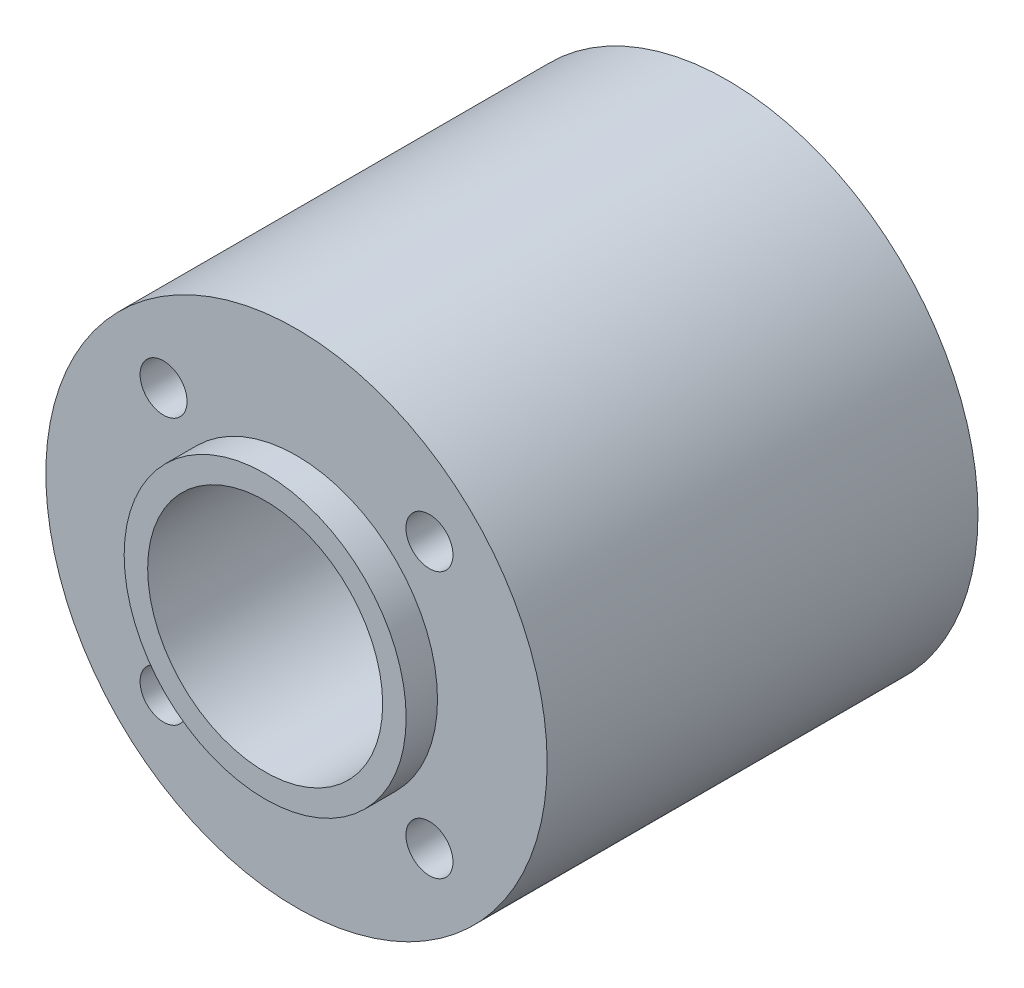
ISO-10303-21;
HEADER;
FILE_DESCRIPTION(('STEP AP214'),'2;1');
FILE_NAME('part.step','',(''),(''),'','','');
FILE_SCHEMA(('AUTOMOTIVE_DESIGN { 1 0 10303 214 1 1 1 1 }'));
ENDSEC;
DATA;
#1=APPLICATION_CONTEXT('core data for automotive mechanical design processes');
#2=APPLICATION_PROTOCOL_DEFINITION('international standard','automotive_design',2000,#1);
#3=PRODUCT_CONTEXT('',#1,'mechanical');
#4=PRODUCT('Part','Part','',(#3));
#5=PRODUCT_RELATED_PRODUCT_CATEGORY('part','',(#4));
#6=PRODUCT_DEFINITION_FORMATION('','',#4);
#7=PRODUCT_DEFINITION_CONTEXT('part definition',#1,'design');
#8=PRODUCT_DEFINITION('design','',#6,#7);
#9=PRODUCT_DEFINITION_SHAPE('','',#8);
#10=(LENGTH_UNIT() NAMED_UNIT(*) SI_UNIT(.MILLI.,.METRE.));
#11=(NAMED_UNIT(*) PLANE_ANGLE_UNIT() SI_UNIT($,.RADIAN.));
#12=(NAMED_UNIT(*) SI_UNIT($,.STERADIAN.) SOLID_ANGLE_UNIT());
#13=UNCERTAINTY_MEASURE_WITH_UNIT(LENGTH_MEASURE(1.E-05),#10,'distance_accuracy_value','');
#14=(GEOMETRIC_REPRESENTATION_CONTEXT(3) GLOBAL_UNCERTAINTY_ASSIGNED_CONTEXT((#13)) GLOBAL_UNIT_ASSIGNED_CONTEXT((#10,
#11,#12)) REPRESENTATION_CONTEXT('',''));
#15=CARTESIAN_POINT('',(0.,0.,0.));
#16=DIRECTION('',(0.,0.,1.));
#17=DIRECTION('',(1.,0.,0.));
#18=AXIS2_PLACEMENT_3D('',#15,#16,#17);
#19=CARTESIAN_POINT('',(0.,0.,55.));
#20=DIRECTION('',(0.,0.,-1.));
#21=DIRECTION('',(1.,0.,0.));
#22=AXIS2_PLACEMENT_3D('',#19,#20,#21);
#23=CYLINDRICAL_SURFACE('',#22,32.);
#24=CARTESIAN_POINT('',(0.,0.,55.));
#25=DIRECTION('',(0.,0.,1.));
#26=DIRECTION('',(1.,0.,0.));
#27=AXIS2_PLACEMENT_3D('',#24,#25,#26);
#28=CIRCLE('',#27,32.);
#29=CARTESIAN_POINT('',(32.,0.,55.));
#30=VERTEX_POINT('',#29);
#31=EDGE_CURVE('E10',#30,#30,#28,.T.);
#32=ORIENTED_EDGE('',*,*,#31,.F.);
#33=EDGE_LOOP('',(#32));
#34=FACE_BOUND('',#33,.T.);
#35=CARTESIAN_POINT('',(0.,0.,0.));
#36=DIRECTION('',(0.,0.,1.));
#37=DIRECTION('',(1.,0.,0.));
#38=AXIS2_PLACEMENT_3D('',#35,#36,#37);
#39=CIRCLE('',#38,32.);
#40=CARTESIAN_POINT('',(32.,0.,0.));
#41=VERTEX_POINT('',#40);
#42=EDGE_CURVE('E42',#41,#41,#39,.T.);
#43=ORIENTED_EDGE('',*,*,#42,.T.);
#44=EDGE_LOOP('',(#43));
#45=FACE_BOUND('',#44,.T.);
#46=ADVANCED_FACE('F39',(#34,#45),#23,.T.);
#47=CARTESIAN_POINT('',(0.,0.,55.));
#48=DIRECTION('',(0.,0.,-1.));
#49=DIRECTION('',(1.,0.,0.));
#50=AXIS2_PLACEMENT_3D('',#47,#48,#49);
#51=CYLINDRICAL_SURFACE('',#50,15.);
#52=CARTESIAN_POINT('',(0.,0.,-4.));
#53=DIRECTION('',(0.,0.,1.));
#54=DIRECTION('',(1.,0.,0.));
#55=AXIS2_PLACEMENT_3D('',#52,#53,#54);
#56=CIRCLE('',#55,15.);
#57=CARTESIAN_POINT('',(15.,0.,-4.));
#58=VERTEX_POINT('',#57);
#59=EDGE_CURVE('E54',#58,#58,#56,.T.);
#60=ORIENTED_EDGE('',*,*,#59,.F.);
#61=EDGE_LOOP('',(#60));
#62=FACE_BOUND('',#61,.T.);
#63=CARTESIAN_POINT('',(0.,0.,59.));
#64=DIRECTION('',(0.,0.,1.));
#65=DIRECTION('',(1.,0.,0.));
#66=AXIS2_PLACEMENT_3D('',#63,#64,#65);
#67=CIRCLE('',#66,15.);
#68=CARTESIAN_POINT('',(15.,0.,59.));
#69=VERTEX_POINT('',#68);
#70=EDGE_CURVE('E63',#69,#69,#67,.T.);
#71=ORIENTED_EDGE('',*,*,#70,.T.);
#72=EDGE_LOOP('',(#71));
#73=FACE_BOUND('',#72,.T.);
#74=ADVANCED_FACE('F107',(#62,#73),#51,.F.);
#75=CARTESIAN_POINT('',(0.,0.,55.));
#76=DIRECTION('',(0.,0.,-1.));
#77=DIRECTION('',(1.,0.,0.));
#78=AXIS2_PLACEMENT_3D('',#75,#76,#77);
#79=PLANE('',#78);
#80=CARTESIAN_POINT('',(-16.9705627484771,-16.9705627484772,55.));
#81=DIRECTION('',(0.,0.,1.));
#82=DIRECTION('',(1.,0.,0.));
#83=AXIS2_PLACEMENT_3D('',#80,#81,#82);
#84=CIRCLE('',#83,3.00000000000022);
#85=CARTESIAN_POINT('',(-13.9705627484768,-16.9705627484772,55.));
#86=VERTEX_POINT('',#85);
#87=EDGE_CURVE('E68',#86,#86,#84,.T.);
#88=ORIENTED_EDGE('',*,*,#87,.F.);
#89=EDGE_LOOP('',(#88));
#90=FACE_BOUND('',#89,.T.);
#91=CARTESIAN_POINT('',(16.9705627484772,-16.9705627484771,55.));
#92=DIRECTION('',(0.,0.,1.));
#93=DIRECTION('',(1.,0.,0.));
#94=AXIS2_PLACEMENT_3D('',#91,#92,#93);
#95=CIRCLE('',#94,3.00000000000015);
#96=CARTESIAN_POINT('',(19.9705627484774,-16.9705627484771,55.));
#97=VERTEX_POINT('',#96);
#98=EDGE_CURVE('E71',#97,#97,#95,.T.);
#99=ORIENTED_EDGE('',*,*,#98,.F.);
#100=EDGE_LOOP('',(#99));
#101=FACE_BOUND('',#100,.T.);
#102=CARTESIAN_POINT('',(16.9705627484771,16.9705627484772,55.));
#103=DIRECTION('',(0.,0.,1.));
#104=DIRECTION('',(1.,0.,0.));
#105=AXIS2_PLACEMENT_3D('',#102,#103,#104);
#106=CIRCLE('',#105,3.00000000000007);
#107=CARTESIAN_POINT('',(19.9705627484771,16.9705627484772,55.));
#108=VERTEX_POINT('',#107);
#109=EDGE_CURVE('E74',#108,#108,#106,.T.);
#110=ORIENTED_EDGE('',*,*,#109,.F.);
#111=EDGE_LOOP('',(#110));
#112=FACE_BOUND('',#111,.T.);
#113=CARTESIAN_POINT('',(-16.9705627484772,16.9705627484771,55.));
#114=DIRECTION('',(0.,0.,1.));
#115=DIRECTION('',(1.,0.,0.));
#116=AXIS2_PLACEMENT_3D('',#113,#114,#115);
#117=CIRCLE('',#116,3.);
#118=CARTESIAN_POINT('',(-13.9705627484772,16.9705627484771,55.));
#119=VERTEX_POINT('',#118);
#120=EDGE_CURVE('E77',#119,#119,#117,.T.);
#121=ORIENTED_EDGE('',*,*,#120,.F.);
#122=EDGE_LOOP('',(#121));
#123=FACE_BOUND('',#122,.T.);
#124=CARTESIAN_POINT('',(0.,0.,55.));
#125=DIRECTION('',(0.,0.,1.));
#126=DIRECTION('',(1.,0.,0.));
#127=AXIS2_PLACEMENT_3D('',#124,#125,#126);
#128=CIRCLE('',#127,18.);
#129=CARTESIAN_POINT('',(18.,0.,55.));
#130=VERTEX_POINT('',#129);
#131=EDGE_CURVE('E60',#130,#130,#128,.T.);
#132=ORIENTED_EDGE('',*,*,#131,.F.);
#133=EDGE_LOOP('',(#132));
#134=FACE_BOUND('',#133,.T.);
#135=ORIENTED_EDGE('',*,*,#31,.T.);
#136=EDGE_LOOP('',(#135));
#137=FACE_BOUND('',#136,.T.);
#138=ADVANCED_FACE('F104',(#90,#101,#112,#123,#134,#137),#79,.F.);
#139=CARTESIAN_POINT('',(0.,0.,0.));
#140=DIRECTION('',(0.,0.,-1.));
#141=DIRECTION('',(1.,0.,0.));
#142=AXIS2_PLACEMENT_3D('',#139,#140,#141);
#143=PLANE('',#142);
#144=CARTESIAN_POINT('',(-16.9705627484771,-16.9705627484772,0.));
#145=DIRECTION('',(0.,0.,1.));
#146=DIRECTION('',(1.,0.,0.));
#147=AXIS2_PLACEMENT_3D('',#144,#145,#146);
#148=CIRCLE('',#147,3.00000000000022);
#149=CARTESIAN_POINT('',(-13.9705627484768,-16.9705627484772,0.));
#150=VERTEX_POINT('',#149);
#151=EDGE_CURVE('E84',#150,#150,#148,.T.);
#152=ORIENTED_EDGE('',*,*,#151,.T.);
#153=EDGE_LOOP('',(#152));
#154=FACE_BOUND('',#153,.T.);
#155=CARTESIAN_POINT('',(16.9705627484772,-16.9705627484771,0.));
#156=DIRECTION('',(0.,0.,1.));
#157=DIRECTION('',(1.,0.,0.));
#158=AXIS2_PLACEMENT_3D('',#155,#156,#157);
#159=CIRCLE('',#158,3.00000000000015);
#160=CARTESIAN_POINT('',(19.9705627484774,-16.9705627484771,0.));
#161=VERTEX_POINT('',#160);
#162=EDGE_CURVE('E87',#161,#161,#159,.T.);
#163=ORIENTED_EDGE('',*,*,#162,.T.);
#164=EDGE_LOOP('',(#163));
#165=FACE_BOUND('',#164,.T.);
#166=CARTESIAN_POINT('',(16.9705627484771,16.9705627484772,0.));
#167=DIRECTION('',(0.,0.,1.));
#168=DIRECTION('',(1.,0.,0.));
#169=AXIS2_PLACEMENT_3D('',#166,#167,#168);
#170=CIRCLE('',#169,3.00000000000007);
#171=CARTESIAN_POINT('',(19.9705627484771,16.9705627484772,0.));
#172=VERTEX_POINT('',#171);
#173=EDGE_CURVE('E83',#172,#172,#170,.T.);
#174=ORIENTED_EDGE('',*,*,#173,.T.);
#175=EDGE_LOOP('',(#174));
#176=FACE_BOUND('',#175,.T.);
#177=CARTESIAN_POINT('',(-16.9705627484772,16.9705627484771,0.));
#178=DIRECTION('',(0.,0.,1.));
#179=DIRECTION('',(1.,0.,0.));
#180=AXIS2_PLACEMENT_3D('',#177,#178,#179);
#181=CIRCLE('',#180,3.);
#182=CARTESIAN_POINT('',(-13.9705627484772,16.9705627484771,0.));
#183=VERTEX_POINT('',#182);
#184=EDGE_CURVE('E80',#183,#183,#181,.T.);
#185=ORIENTED_EDGE('',*,*,#184,.T.);
#186=EDGE_LOOP('',(#185));
#187=FACE_BOUND('',#186,.T.);
#188=CARTESIAN_POINT('',(0.,0.,0.));
#189=DIRECTION('',(0.,0.,1.));
#190=DIRECTION('',(1.,0.,0.));
#191=AXIS2_PLACEMENT_3D('',#188,#189,#190);
#192=CIRCLE('',#191,18.);
#193=CARTESIAN_POINT('',(18.,0.,0.));
#194=VERTEX_POINT('',#193);
#195=EDGE_CURVE('E51',#194,#194,#192,.T.);
#196=ORIENTED_EDGE('',*,*,#195,.T.);
#197=EDGE_LOOP('',(#196));
#198=FACE_BOUND('',#197,.T.);
#199=ORIENTED_EDGE('',*,*,#42,.F.);
#200=EDGE_LOOP('',(#199));
#201=FACE_BOUND('',#200,.T.);
#202=ADVANCED_FACE('F93',(#154,#165,#176,#187,#198,#201),#143,.T.);
#203=CARTESIAN_POINT('',(0.,0.,-4.));
#204=DIRECTION('',(0.,0.,1.));
#205=DIRECTION('',(-1.,0.,0.));
#206=AXIS2_PLACEMENT_3D('',#203,#204,#205);
#207=CYLINDRICAL_SURFACE('',#206,18.);
#208=CARTESIAN_POINT('',(0.,0.,-4.));
#209=DIRECTION('',(0.,0.,1.));
#210=DIRECTION('',(1.,0.,0.));
#211=AXIS2_PLACEMENT_3D('',#208,#209,#210);
#212=CIRCLE('',#211,18.);
#213=CARTESIAN_POINT('',(18.,0.,-4.));
#214=VERTEX_POINT('',#213);
#215=EDGE_CURVE('E49',#214,#214,#212,.T.);
#216=ORIENTED_EDGE('',*,*,#215,.T.);
#217=EDGE_LOOP('',(#216));
#218=FACE_BOUND('',#217,.T.);
#219=ORIENTED_EDGE('',*,*,#195,.F.);
#220=EDGE_LOOP('',(#219));
#221=FACE_BOUND('',#220,.T.);
#222=ADVANCED_FACE('F126',(#218,#221),#207,.T.);
#223=CARTESIAN_POINT('',(0.,0.,-4.));
#224=DIRECTION('',(0.,0.,-1.));
#225=DIRECTION('',(1.,0.,0.));
#226=AXIS2_PLACEMENT_3D('',#223,#224,#225);
#227=PLANE('',#226);
#228=ORIENTED_EDGE('',*,*,#59,.T.);
#229=EDGE_LOOP('',(#228));
#230=FACE_BOUND('',#229,.T.);
#231=ORIENTED_EDGE('',*,*,#215,.F.);
#232=EDGE_LOOP('',(#231));
#233=FACE_BOUND('',#232,.T.);
#234=ADVANCED_FACE('F117',(#230,#233),#227,.T.);
#235=CARTESIAN_POINT('',(0.,0.,59.));
#236=DIRECTION('',(0.,0.,-1.));
#237=DIRECTION('',(1.,0.,0.));
#238=AXIS2_PLACEMENT_3D('',#235,#236,#237);
#239=CYLINDRICAL_SURFACE('',#238,18.);
#240=CARTESIAN_POINT('',(0.,0.,59.));
#241=DIRECTION('',(0.,0.,1.));
#242=DIRECTION('',(1.,0.,0.));
#243=AXIS2_PLACEMENT_3D('',#240,#241,#242);
#244=CIRCLE('',#243,18.);
#245=CARTESIAN_POINT('',(18.,0.,59.));
#246=VERTEX_POINT('',#245);
#247=EDGE_CURVE('E55',#246,#246,#244,.T.);
#248=ORIENTED_EDGE('',*,*,#247,.F.);
#249=EDGE_LOOP('',(#248));
#250=FACE_BOUND('',#249,.T.);
#251=ORIENTED_EDGE('',*,*,#131,.T.);
#252=EDGE_LOOP('',(#251));
#253=FACE_BOUND('',#252,.T.);
#254=ADVANCED_FACE('F114',(#250,#253),#239,.T.);
#255=CARTESIAN_POINT('',(0.,0.,59.));
#256=DIRECTION('',(0.,0.,-1.));
#257=DIRECTION('',(1.,0.,0.));
#258=AXIS2_PLACEMENT_3D('',#255,#256,#257);
#259=PLANE('',#258);
#260=ORIENTED_EDGE('',*,*,#70,.F.);
#261=EDGE_LOOP('',(#260));
#262=FACE_BOUND('',#261,.T.);
#263=ORIENTED_EDGE('',*,*,#247,.T.);
#264=EDGE_LOOP('',(#263));
#265=FACE_BOUND('',#264,.T.);
#266=ADVANCED_FACE('F116',(#262,#265),#259,.F.);
#267=CARTESIAN_POINT('',(-16.9705627484772,16.9705627484771,191.));
#268=DIRECTION('',(0.,0.,-1.));
#269=DIRECTION('',(1.,0.,0.));
#270=AXIS2_PLACEMENT_3D('',#267,#268,#269);
#271=CYLINDRICAL_SURFACE('',#270,3.);
#272=CARTESIAN_POINT('',(-13.9705627484772,16.9705627484771,0.));
#273=CARTESIAN_POINT('',(-13.9705627484772,16.9705627484771,0.572916666666663));
#274=CARTESIAN_POINT('',(-13.9705627484772,16.9705627484771,1.14583333333333));
#275=CARTESIAN_POINT('',(-13.9705627484772,16.9705627484771,2.29166666666666));
#276=CARTESIAN_POINT('',(-13.9705627484772,16.9705627484771,2.86458333333334));
#277=CARTESIAN_POINT('',(-13.9705627484772,16.9705627484771,4.01041666666667));
#278=CARTESIAN_POINT('',(-13.9705627484772,16.9705627484771,4.58333333333334));
#279=CARTESIAN_POINT('',(-13.9705627484772,16.9705627484771,5.72916666666666));
#280=CARTESIAN_POINT('',(-13.9705627484772,16.9705627484771,6.30208333333333));
#281=CARTESIAN_POINT('',(-13.9705627484772,16.9705627484771,7.44791666666667));
#282=CARTESIAN_POINT('',(-13.9705627484772,16.9705627484771,8.02083333333334));
#283=CARTESIAN_POINT('',(-13.9705627484772,16.9705627484771,9.16666666666667));
#284=CARTESIAN_POINT('',(-13.9705627484772,16.9705627484771,9.73958333333334));
#285=CARTESIAN_POINT('',(-13.9705627484772,16.9705627484771,10.8854166666667));
#286=CARTESIAN_POINT('',(-13.9705627484772,16.9705627484771,11.4583333333333));
#287=CARTESIAN_POINT('',(-13.9705627484772,16.9705627484771,12.6041666666667));
#288=CARTESIAN_POINT('',(-13.9705627484772,16.9705627484771,13.1770833333333));
#289=CARTESIAN_POINT('',(-13.9705627484772,16.9705627484771,14.3229166666667));
#290=CARTESIAN_POINT('',(-13.9705627484772,16.9705627484771,14.8958333333333));
#291=CARTESIAN_POINT('',(-13.9705627484772,16.9705627484771,16.0416666666667));
#292=CARTESIAN_POINT('',(-13.9705627484772,16.9705627484771,16.6145833333333));
#293=CARTESIAN_POINT('',(-13.9705627484772,16.9705627484771,17.7604166666667));
#294=CARTESIAN_POINT('',(-13.9705627484772,16.9705627484771,18.3333333333333));
#295=CARTESIAN_POINT('',(-13.9705627484772,16.9705627484771,19.4791666666667));
#296=CARTESIAN_POINT('',(-13.9705627484772,16.9705627484771,20.0520833333333));
#297=CARTESIAN_POINT('',(-13.9705627484772,16.9705627484771,21.1979166666667));
#298=CARTESIAN_POINT('',(-13.9705627484772,16.9705627484771,21.7708333333333));
#299=CARTESIAN_POINT('',(-13.9705627484772,16.9705627484771,22.9166666666667));
#300=CARTESIAN_POINT('',(-13.9705627484772,16.9705627484771,23.4895833333333));
#301=CARTESIAN_POINT('',(-13.9705627484772,16.9705627484771,24.6354166666667));
#302=CARTESIAN_POINT('',(-13.9705627484772,16.9705627484771,25.2083333333333));
#303=CARTESIAN_POINT('',(-13.9705627484772,16.9705627484771,26.3541666666667));
#304=CARTESIAN_POINT('',(-13.9705627484772,16.9705627484771,26.9270833333333));
#305=CARTESIAN_POINT('',(-13.9705627484772,16.9705627484771,28.0729166666667));
#306=CARTESIAN_POINT('',(-13.9705627484772,16.9705627484771,28.6458333333333));
#307=CARTESIAN_POINT('',(-13.9705627484772,16.9705627484771,29.7916666666667));
#308=CARTESIAN_POINT('',(-13.9705627484772,16.9705627484771,30.3645833333333));
#309=CARTESIAN_POINT('',(-13.9705627484772,16.9705627484771,31.5104166666667));
#310=CARTESIAN_POINT('',(-13.9705627484772,16.9705627484771,32.0833333333333));
#311=CARTESIAN_POINT('',(-13.9705627484772,16.9705627484771,33.2291666666667));
#312=CARTESIAN_POINT('',(-13.9705627484772,16.9705627484771,33.8020833333333));
#313=CARTESIAN_POINT('',(-13.9705627484772,16.9705627484771,34.9479166666667));
#314=CARTESIAN_POINT('',(-13.9705627484772,16.9705627484771,35.5208333333333));
#315=CARTESIAN_POINT('',(-13.9705627484772,16.9705627484771,36.6666666666667));
#316=CARTESIAN_POINT('',(-13.9705627484772,16.9705627484771,37.2395833333333));
#317=CARTESIAN_POINT('',(-13.9705627484772,16.9705627484771,38.3854166666667));
#318=CARTESIAN_POINT('',(-13.9705627484772,16.9705627484771,38.9583333333333));
#319=CARTESIAN_POINT('',(-13.9705627484772,16.9705627484771,40.1041666666667));
#320=CARTESIAN_POINT('',(-13.9705627484772,16.9705627484771,40.6770833333333));
#321=CARTESIAN_POINT('',(-13.9705627484772,16.9705627484771,41.8229166666667));
#322=CARTESIAN_POINT('',(-13.9705627484772,16.9705627484771,42.3958333333333));
#323=CARTESIAN_POINT('',(-13.9705627484772,16.9705627484771,43.5416666666667));
#324=CARTESIAN_POINT('',(-13.9705627484772,16.9705627484771,44.1145833333333));
#325=CARTESIAN_POINT('',(-13.9705627484772,16.9705627484771,45.2604166666667));
#326=CARTESIAN_POINT('',(-13.9705627484772,16.9705627484771,45.8333333333333));
#327=CARTESIAN_POINT('',(-13.9705627484772,16.9705627484771,46.9791666666667));
#328=CARTESIAN_POINT('',(-13.9705627484772,16.9705627484771,47.5520833333333));
#329=CARTESIAN_POINT('',(-13.9705627484772,16.9705627484771,48.6979166666667));
#330=CARTESIAN_POINT('',(-13.9705627484772,16.9705627484771,49.2708333333333));
#331=CARTESIAN_POINT('',(-13.9705627484772,16.9705627484771,50.4166666666667));
#332=CARTESIAN_POINT('',(-13.9705627484772,16.9705627484771,50.9895833333333));
#333=CARTESIAN_POINT('',(-13.9705627484772,16.9705627484771,52.1354166666667));
#334=CARTESIAN_POINT('',(-13.9705627484772,16.9705627484771,52.7083333333333));
#335=CARTESIAN_POINT('',(-13.9705627484772,16.9705627484771,53.8541666666667));
#336=CARTESIAN_POINT('',(-13.9705627484772,16.9705627484771,54.4270833333333));
#337=CARTESIAN_POINT('',(-13.9705627484772,16.9705627484771,55.));
#338=B_SPLINE_CURVE_WITH_KNOTS('',3,(#272,#273,#274,#275,#276,#277,#278,#279,#280,#281,#282,
#283,#284,#285,#286,#287,#288,#289,#290,#291,#292,#293,#294,#295,#296,#297,#298,#299,#300,#301,
#302,#303,#304,#305,#306,#307,#308,#309,#310,#311,#312,#313,#314,#315,#316,#317,#318,#319,#320,
#321,#322,#323,#324,#325,#326,#327,#328,#329,#330,#331,#332,#333,#334,#335,#336,#337),
.UNSPECIFIED.,.F.,.F.,(4,2,2,2,2,2,2,2,2,2,2,2,2,2,2,2,2,2,2,2,2,2,2,2,2,2,2,2,2,2,2,2,4),(0.,
1.71874999999999,3.43750000000001,5.15625,6.87499999999999,8.59375000000001,10.3125,12.03125,
13.75,15.46875,17.1875,18.90625,20.625,22.34375,24.0625,25.78125,27.5,29.21875,30.9375,32.65625,
34.375,36.09375,37.8125,39.53125,41.25,42.96875,44.6875,46.40625,48.125,49.84375,51.5625,
53.28125,55.),.UNSPECIFIED.);
#339=EDGE_CURVE('BSEAM100',#183,#119,#338,.T.);
#340=ORIENTED_EDGE('',*,*,#184,.F.);
#341=ORIENTED_EDGE('',*,*,#120,.T.);
#342=ORIENTED_EDGE('',*,*,#339,.T.);
#343=ORIENTED_EDGE('',*,*,#339,.F.);
#344=EDGE_LOOP('',(#340,#342,#341,#343));
#345=FACE_BOUND('',#344,.T.);
#346=ADVANCED_FACE('F100',(#345),#271,.F.);
#347=CARTESIAN_POINT('',(16.9705627484771,16.9705627484772,191.));
#348=DIRECTION('',(0.,0.,-1.));
#349=DIRECTION('',(1.,0.,0.));
#350=AXIS2_PLACEMENT_3D('',#347,#348,#349);
#351=CYLINDRICAL_SURFACE('',#350,3.00000000000007);
#352=CARTESIAN_POINT('',(19.9705627484771,16.9705627484772,0.));
#353=CARTESIAN_POINT('',(19.9705627484771,16.9705627484772,0.572916666666663));
#354=CARTESIAN_POINT('',(19.9705627484771,16.9705627484772,1.14583333333333));
#355=CARTESIAN_POINT('',(19.9705627484771,16.9705627484772,2.29166666666666));
#356=CARTESIAN_POINT('',(19.9705627484771,16.9705627484772,2.86458333333334));
#357=CARTESIAN_POINT('',(19.9705627484771,16.9705627484772,4.01041666666667));
#358=CARTESIAN_POINT('',(19.9705627484771,16.9705627484772,4.58333333333334));
#359=CARTESIAN_POINT('',(19.9705627484771,16.9705627484772,5.72916666666666));
#360=CARTESIAN_POINT('',(19.9705627484771,16.9705627484772,6.30208333333333));
#361=CARTESIAN_POINT('',(19.9705627484771,16.9705627484772,7.44791666666667));
#362=CARTESIAN_POINT('',(19.9705627484771,16.9705627484772,8.02083333333334));
#363=CARTESIAN_POINT('',(19.9705627484771,16.9705627484772,9.16666666666667));
#364=CARTESIAN_POINT('',(19.9705627484771,16.9705627484772,9.73958333333334));
#365=CARTESIAN_POINT('',(19.9705627484771,16.9705627484772,10.8854166666667));
#366=CARTESIAN_POINT('',(19.9705627484771,16.9705627484772,11.4583333333333));
#367=CARTESIAN_POINT('',(19.9705627484771,16.9705627484772,12.6041666666667));
#368=CARTESIAN_POINT('',(19.9705627484771,16.9705627484772,13.1770833333333));
#369=CARTESIAN_POINT('',(19.9705627484771,16.9705627484772,14.3229166666667));
#370=CARTESIAN_POINT('',(19.9705627484771,16.9705627484772,14.8958333333333));
#371=CARTESIAN_POINT('',(19.9705627484771,16.9705627484772,16.0416666666667));
#372=CARTESIAN_POINT('',(19.9705627484771,16.9705627484772,16.6145833333333));
#373=CARTESIAN_POINT('',(19.9705627484771,16.9705627484772,17.7604166666667));
#374=CARTESIAN_POINT('',(19.9705627484771,16.9705627484772,18.3333333333333));
#375=CARTESIAN_POINT('',(19.9705627484771,16.9705627484772,19.4791666666667));
#376=CARTESIAN_POINT('',(19.9705627484771,16.9705627484772,20.0520833333333));
#377=CARTESIAN_POINT('',(19.9705627484771,16.9705627484772,21.1979166666667));
#378=CARTESIAN_POINT('',(19.9705627484771,16.9705627484772,21.7708333333333));
#379=CARTESIAN_POINT('',(19.9705627484771,16.9705627484772,22.9166666666667));
#380=CARTESIAN_POINT('',(19.9705627484771,16.9705627484772,23.4895833333333));
#381=CARTESIAN_POINT('',(19.9705627484771,16.9705627484772,24.6354166666667));
#382=CARTESIAN_POINT('',(19.9705627484771,16.9705627484772,25.2083333333333));
#383=CARTESIAN_POINT('',(19.9705627484771,16.9705627484772,26.3541666666667));
#384=CARTESIAN_POINT('',(19.9705627484771,16.9705627484772,26.9270833333333));
#385=CARTESIAN_POINT('',(19.9705627484771,16.9705627484772,28.0729166666667));
#386=CARTESIAN_POINT('',(19.9705627484771,16.9705627484772,28.6458333333333));
#387=CARTESIAN_POINT('',(19.9705627484771,16.9705627484772,29.7916666666667));
#388=CARTESIAN_POINT('',(19.9705627484771,16.9705627484772,30.3645833333333));
#389=CARTESIAN_POINT('',(19.9705627484771,16.9705627484772,31.5104166666667));
#390=CARTESIAN_POINT('',(19.9705627484771,16.9705627484772,32.0833333333333));
#391=CARTESIAN_POINT('',(19.9705627484771,16.9705627484772,33.2291666666667));
#392=CARTESIAN_POINT('',(19.9705627484771,16.9705627484772,33.8020833333333));
#393=CARTESIAN_POINT('',(19.9705627484771,16.9705627484772,34.9479166666667));
#394=CARTESIAN_POINT('',(19.9705627484771,16.9705627484772,35.5208333333333));
#395=CARTESIAN_POINT('',(19.9705627484771,16.9705627484772,36.6666666666667));
#396=CARTESIAN_POINT('',(19.9705627484771,16.9705627484772,37.2395833333333));
#397=CARTESIAN_POINT('',(19.9705627484771,16.9705627484772,38.3854166666667));
#398=CARTESIAN_POINT('',(19.9705627484771,16.9705627484772,38.9583333333333));
#399=CARTESIAN_POINT('',(19.9705627484771,16.9705627484772,40.1041666666667));
#400=CARTESIAN_POINT('',(19.9705627484771,16.9705627484772,40.6770833333333));
#401=CARTESIAN_POINT('',(19.9705627484771,16.9705627484772,41.8229166666667));
#402=CARTESIAN_POINT('',(19.9705627484771,16.9705627484772,42.3958333333333));
#403=CARTESIAN_POINT('',(19.9705627484771,16.9705627484772,43.5416666666667));
#404=CARTESIAN_POINT('',(19.9705627484771,16.9705627484772,44.1145833333333));
#405=CARTESIAN_POINT('',(19.9705627484771,16.9705627484772,45.2604166666667));
#406=CARTESIAN_POINT('',(19.9705627484771,16.9705627484772,45.8333333333333));
#407=CARTESIAN_POINT('',(19.9705627484771,16.9705627484772,46.9791666666667));
#408=CARTESIAN_POINT('',(19.9705627484771,16.9705627484772,47.5520833333333));
#409=CARTESIAN_POINT('',(19.9705627484771,16.9705627484772,48.6979166666667));
#410=CARTESIAN_POINT('',(19.9705627484771,16.9705627484772,49.2708333333333));
#411=CARTESIAN_POINT('',(19.9705627484771,16.9705627484772,50.4166666666667));
#412=CARTESIAN_POINT('',(19.9705627484771,16.9705627484772,50.9895833333333));
#413=CARTESIAN_POINT('',(19.9705627484771,16.9705627484772,52.1354166666667));
#414=CARTESIAN_POINT('',(19.9705627484771,16.9705627484772,52.7083333333333));
#415=CARTESIAN_POINT('',(19.9705627484771,16.9705627484772,53.8541666666667));
#416=CARTESIAN_POINT('',(19.9705627484771,16.9705627484772,54.4270833333333));
#417=CARTESIAN_POINT('',(19.9705627484771,16.9705627484772,55.));
#418=B_SPLINE_CURVE_WITH_KNOTS('',3,(#352,#353,#354,#355,#356,#357,#358,#359,#360,#361,#362,
#363,#364,#365,#366,#367,#368,#369,#370,#371,#372,#373,#374,#375,#376,#377,#378,#379,#380,#381,
#382,#383,#384,#385,#386,#387,#388,#389,#390,#391,#392,#393,#394,#395,#396,#397,#398,#399,#400,
#401,#402,#403,#404,#405,#406,#407,#408,#409,#410,#411,#412,#413,#414,#415,#416,#417),
.UNSPECIFIED.,.F.,.F.,(4,2,2,2,2,2,2,2,2,2,2,2,2,2,2,2,2,2,2,2,2,2,2,2,2,2,2,2,2,2,2,2,4),(0.,
1.71874999999999,3.43750000000001,5.15625,6.87499999999999,8.59375000000001,10.3125,12.03125,
13.75,15.46875,17.1875,18.90625,20.625,22.34375,24.0625,25.78125,27.5,29.21875,30.9375,32.65625,
34.375,36.09375,37.8125,39.53125,41.25,42.96875,44.6875,46.40625,48.125,49.84375,51.5625,
53.28125,55.),.UNSPECIFIED.);
#419=EDGE_CURVE('BSEAM96',#172,#108,#418,.T.);
#420=ORIENTED_EDGE('',*,*,#173,.F.);
#421=ORIENTED_EDGE('',*,*,#109,.T.);
#422=ORIENTED_EDGE('',*,*,#419,.T.);
#423=ORIENTED_EDGE('',*,*,#419,.F.);
#424=EDGE_LOOP('',(#420,#422,#421,#423));
#425=FACE_BOUND('',#424,.T.);
#426=ADVANCED_FACE('F96',(#425),#351,.F.);
#427=CARTESIAN_POINT('',(16.9705627484772,-16.9705627484771,191.));
#428=DIRECTION('',(0.,0.,-1.));
#429=DIRECTION('',(1.,0.,0.));
#430=AXIS2_PLACEMENT_3D('',#427,#428,#429);
#431=CYLINDRICAL_SURFACE('',#430,3.00000000000015);
#432=CARTESIAN_POINT('',(19.9705627484774,-16.9705627484771,0.));
#433=CARTESIAN_POINT('',(19.9705627484774,-16.9705627484771,0.572916666666663));
#434=CARTESIAN_POINT('',(19.9705627484774,-16.9705627484771,1.14583333333333));
#435=CARTESIAN_POINT('',(19.9705627484774,-16.9705627484771,2.29166666666666));
#436=CARTESIAN_POINT('',(19.9705627484774,-16.9705627484771,2.86458333333334));
#437=CARTESIAN_POINT('',(19.9705627484774,-16.9705627484771,4.01041666666667));
#438=CARTESIAN_POINT('',(19.9705627484774,-16.9705627484771,4.58333333333334));
#439=CARTESIAN_POINT('',(19.9705627484774,-16.9705627484771,5.72916666666666));
#440=CARTESIAN_POINT('',(19.9705627484774,-16.9705627484771,6.30208333333333));
#441=CARTESIAN_POINT('',(19.9705627484774,-16.9705627484771,7.44791666666667));
#442=CARTESIAN_POINT('',(19.9705627484774,-16.9705627484771,8.02083333333334));
#443=CARTESIAN_POINT('',(19.9705627484774,-16.9705627484771,9.16666666666667));
#444=CARTESIAN_POINT('',(19.9705627484774,-16.9705627484771,9.73958333333334));
#445=CARTESIAN_POINT('',(19.9705627484774,-16.9705627484771,10.8854166666667));
#446=CARTESIAN_POINT('',(19.9705627484774,-16.9705627484771,11.4583333333333));
#447=CARTESIAN_POINT('',(19.9705627484774,-16.9705627484771,12.6041666666667));
#448=CARTESIAN_POINT('',(19.9705627484774,-16.9705627484771,13.1770833333333));
#449=CARTESIAN_POINT('',(19.9705627484774,-16.9705627484771,14.3229166666667));
#450=CARTESIAN_POINT('',(19.9705627484774,-16.9705627484771,14.8958333333333));
#451=CARTESIAN_POINT('',(19.9705627484774,-16.9705627484771,16.0416666666667));
#452=CARTESIAN_POINT('',(19.9705627484774,-16.9705627484771,16.6145833333333));
#453=CARTESIAN_POINT('',(19.9705627484774,-16.9705627484771,17.7604166666667));
#454=CARTESIAN_POINT('',(19.9705627484774,-16.9705627484771,18.3333333333333));
#455=CARTESIAN_POINT('',(19.9705627484774,-16.9705627484771,19.4791666666667));
#456=CARTESIAN_POINT('',(19.9705627484774,-16.9705627484771,20.0520833333333));
#457=CARTESIAN_POINT('',(19.9705627484774,-16.9705627484771,21.1979166666667));
#458=CARTESIAN_POINT('',(19.9705627484774,-16.9705627484771,21.7708333333333));
#459=CARTESIAN_POINT('',(19.9705627484774,-16.9705627484771,22.9166666666667));
#460=CARTESIAN_POINT('',(19.9705627484774,-16.9705627484771,23.4895833333333));
#461=CARTESIAN_POINT('',(19.9705627484774,-16.9705627484771,24.6354166666667));
#462=CARTESIAN_POINT('',(19.9705627484774,-16.9705627484771,25.2083333333333));
#463=CARTESIAN_POINT('',(19.9705627484774,-16.9705627484771,26.3541666666667));
#464=CARTESIAN_POINT('',(19.9705627484774,-16.9705627484771,26.9270833333333));
#465=CARTESIAN_POINT('',(19.9705627484774,-16.9705627484771,28.0729166666667));
#466=CARTESIAN_POINT('',(19.9705627484774,-16.9705627484771,28.6458333333333));
#467=CARTESIAN_POINT('',(19.9705627484774,-16.9705627484771,29.7916666666667));
#468=CARTESIAN_POINT('',(19.9705627484774,-16.9705627484771,30.3645833333333));
#469=CARTESIAN_POINT('',(19.9705627484774,-16.9705627484771,31.5104166666667));
#470=CARTESIAN_POINT('',(19.9705627484774,-16.9705627484771,32.0833333333333));
#471=CARTESIAN_POINT('',(19.9705627484774,-16.9705627484771,33.2291666666667));
#472=CARTESIAN_POINT('',(19.9705627484774,-16.9705627484771,33.8020833333333));
#473=CARTESIAN_POINT('',(19.9705627484774,-16.9705627484771,34.9479166666667));
#474=CARTESIAN_POINT('',(19.9705627484774,-16.9705627484771,35.5208333333333));
#475=CARTESIAN_POINT('',(19.9705627484774,-16.9705627484771,36.6666666666667));
#476=CARTESIAN_POINT('',(19.9705627484774,-16.9705627484771,37.2395833333333));
#477=CARTESIAN_POINT('',(19.9705627484774,-16.9705627484771,38.3854166666667));
#478=CARTESIAN_POINT('',(19.9705627484774,-16.9705627484771,38.9583333333333));
#479=CARTESIAN_POINT('',(19.9705627484774,-16.9705627484771,40.1041666666667));
#480=CARTESIAN_POINT('',(19.9705627484774,-16.9705627484771,40.6770833333333));
#481=CARTESIAN_POINT('',(19.9705627484774,-16.9705627484771,41.8229166666667));
#482=CARTESIAN_POINT('',(19.9705627484774,-16.9705627484771,42.3958333333333));
#483=CARTESIAN_POINT('',(19.9705627484774,-16.9705627484771,43.5416666666667));
#484=CARTESIAN_POINT('',(19.9705627484774,-16.9705627484771,44.1145833333333));
#485=CARTESIAN_POINT('',(19.9705627484774,-16.9705627484771,45.2604166666667));
#486=CARTESIAN_POINT('',(19.9705627484774,-16.9705627484771,45.8333333333333));
#487=CARTESIAN_POINT('',(19.9705627484774,-16.9705627484771,46.9791666666667));
#488=CARTESIAN_POINT('',(19.9705627484774,-16.9705627484771,47.5520833333333));
#489=CARTESIAN_POINT('',(19.9705627484774,-16.9705627484771,48.6979166666667));
#490=CARTESIAN_POINT('',(19.9705627484774,-16.9705627484771,49.2708333333333));
#491=CARTESIAN_POINT('',(19.9705627484774,-16.9705627484771,50.4166666666667));
#492=CARTESIAN_POINT('',(19.9705627484774,-16.9705627484771,50.9895833333333));
#493=CARTESIAN_POINT('',(19.9705627484774,-16.9705627484771,52.1354166666667));
#494=CARTESIAN_POINT('',(19.9705627484774,-16.9705627484771,52.7083333333333));
#495=CARTESIAN_POINT('',(19.9705627484774,-16.9705627484771,53.8541666666667));
#496=CARTESIAN_POINT('',(19.9705627484774,-16.9705627484771,54.4270833333333));
#497=CARTESIAN_POINT('',(19.9705627484774,-16.9705627484771,55.));
#498=B_SPLINE_CURVE_WITH_KNOTS('',3,(#432,#433,#434,#435,#436,#437,#438,#439,#440,#441,#442,
#443,#444,#445,#446,#447,#448,#449,#450,#451,#452,#453,#454,#455,#456,#457,#458,#459,#460,#461,
#462,#463,#464,#465,#466,#467,#468,#469,#470,#471,#472,#473,#474,#475,#476,#477,#478,#479,#480,
#481,#482,#483,#484,#485,#486,#487,#488,#489,#490,#491,#492,#493,#494,#495,#496,#497),
.UNSPECIFIED.,.F.,.F.,(4,2,2,2,2,2,2,2,2,2,2,2,2,2,2,2,2,2,2,2,2,2,2,2,2,2,2,2,2,2,2,2,4),(0.,
1.71874999999999,3.43750000000001,5.15625,6.87499999999999,8.59375000000001,10.3125,12.03125,
13.75,15.46875,17.1875,18.90625,20.625,22.34375,24.0625,25.78125,27.5,29.21875,30.9375,32.65625,
34.375,36.09375,37.8125,39.53125,41.25,42.96875,44.6875,46.40625,48.125,49.84375,51.5625,
53.28125,55.),.UNSPECIFIED.);
#499=EDGE_CURVE('BSEAM99',#161,#97,#498,.T.);
#500=ORIENTED_EDGE('',*,*,#162,.F.);
#501=ORIENTED_EDGE('',*,*,#98,.T.);
#502=ORIENTED_EDGE('',*,*,#499,.T.);
#503=ORIENTED_EDGE('',*,*,#499,.F.);
#504=EDGE_LOOP('',(#500,#502,#501,#503));
#505=FACE_BOUND('',#504,.T.);
#506=ADVANCED_FACE('F99',(#505),#431,.F.);
#507=CARTESIAN_POINT('',(-16.9705627484771,-16.9705627484772,191.));
#508=DIRECTION('',(0.,0.,-1.));
#509=DIRECTION('',(1.,0.,0.));
#510=AXIS2_PLACEMENT_3D('',#507,#508,#509);
#511=CYLINDRICAL_SURFACE('',#510,3.00000000000022);
#512=CARTESIAN_POINT('',(-13.9705627484768,-16.9705627484772,0.));
#513=CARTESIAN_POINT('',(-13.9705627484768,-16.9705627484772,0.572916666666663));
#514=CARTESIAN_POINT('',(-13.9705627484768,-16.9705627484772,1.14583333333333));
#515=CARTESIAN_POINT('',(-13.9705627484768,-16.9705627484772,2.29166666666666));
#516=CARTESIAN_POINT('',(-13.9705627484768,-16.9705627484772,2.86458333333334));
#517=CARTESIAN_POINT('',(-13.9705627484768,-16.9705627484772,4.01041666666667));
#518=CARTESIAN_POINT('',(-13.9705627484768,-16.9705627484772,4.58333333333334));
#519=CARTESIAN_POINT('',(-13.9705627484768,-16.9705627484772,5.72916666666666));
#520=CARTESIAN_POINT('',(-13.9705627484768,-16.9705627484772,6.30208333333333));
#521=CARTESIAN_POINT('',(-13.9705627484768,-16.9705627484772,7.44791666666667));
#522=CARTESIAN_POINT('',(-13.9705627484768,-16.9705627484772,8.02083333333334));
#523=CARTESIAN_POINT('',(-13.9705627484768,-16.9705627484772,9.16666666666667));
#524=CARTESIAN_POINT('',(-13.9705627484768,-16.9705627484772,9.73958333333334));
#525=CARTESIAN_POINT('',(-13.9705627484768,-16.9705627484772,10.8854166666667));
#526=CARTESIAN_POINT('',(-13.9705627484768,-16.9705627484772,11.4583333333333));
#527=CARTESIAN_POINT('',(-13.9705627484768,-16.9705627484772,12.6041666666667));
#528=CARTESIAN_POINT('',(-13.9705627484768,-16.9705627484772,13.1770833333333));
#529=CARTESIAN_POINT('',(-13.9705627484768,-16.9705627484772,14.3229166666667));
#530=CARTESIAN_POINT('',(-13.9705627484768,-16.9705627484772,14.8958333333333));
#531=CARTESIAN_POINT('',(-13.9705627484768,-16.9705627484772,16.0416666666667));
#532=CARTESIAN_POINT('',(-13.9705627484768,-16.9705627484772,16.6145833333333));
#533=CARTESIAN_POINT('',(-13.9705627484768,-16.9705627484772,17.7604166666667));
#534=CARTESIAN_POINT('',(-13.9705627484768,-16.9705627484772,18.3333333333333));
#535=CARTESIAN_POINT('',(-13.9705627484768,-16.9705627484772,19.4791666666667));
#536=CARTESIAN_POINT('',(-13.9705627484768,-16.9705627484772,20.0520833333333));
#537=CARTESIAN_POINT('',(-13.9705627484768,-16.9705627484772,21.1979166666667));
#538=CARTESIAN_POINT('',(-13.9705627484768,-16.9705627484772,21.7708333333333));
#539=CARTESIAN_POINT('',(-13.9705627484768,-16.9705627484772,22.9166666666667));
#540=CARTESIAN_POINT('',(-13.9705627484768,-16.9705627484772,23.4895833333333));
#541=CARTESIAN_POINT('',(-13.9705627484768,-16.9705627484772,24.6354166666667));
#542=CARTESIAN_POINT('',(-13.9705627484768,-16.9705627484772,25.2083333333333));
#543=CARTESIAN_POINT('',(-13.9705627484768,-16.9705627484772,26.3541666666667));
#544=CARTESIAN_POINT('',(-13.9705627484768,-16.9705627484772,26.9270833333333));
#545=CARTESIAN_POINT('',(-13.9705627484768,-16.9705627484772,28.0729166666667));
#546=CARTESIAN_POINT('',(-13.9705627484768,-16.9705627484772,28.6458333333333));
#547=CARTESIAN_POINT('',(-13.9705627484768,-16.9705627484772,29.7916666666667));
#548=CARTESIAN_POINT('',(-13.9705627484768,-16.9705627484772,30.3645833333333));
#549=CARTESIAN_POINT('',(-13.9705627484768,-16.9705627484772,31.5104166666667));
#550=CARTESIAN_POINT('',(-13.9705627484768,-16.9705627484772,32.0833333333333));
#551=CARTESIAN_POINT('',(-13.9705627484768,-16.9705627484772,33.2291666666667));
#552=CARTESIAN_POINT('',(-13.9705627484768,-16.9705627484772,33.8020833333333));
#553=CARTESIAN_POINT('',(-13.9705627484768,-16.9705627484772,34.9479166666667));
#554=CARTESIAN_POINT('',(-13.9705627484768,-16.9705627484772,35.5208333333333));
#555=CARTESIAN_POINT('',(-13.9705627484768,-16.9705627484772,36.6666666666667));
#556=CARTESIAN_POINT('',(-13.9705627484768,-16.9705627484772,37.2395833333333));
#557=CARTESIAN_POINT('',(-13.9705627484768,-16.9705627484772,38.3854166666667));
#558=CARTESIAN_POINT('',(-13.9705627484768,-16.9705627484772,38.9583333333333));
#559=CARTESIAN_POINT('',(-13.9705627484768,-16.9705627484772,40.1041666666667));
#560=CARTESIAN_POINT('',(-13.9705627484768,-16.9705627484772,40.6770833333333));
#561=CARTESIAN_POINT('',(-13.9705627484768,-16.9705627484772,41.8229166666667));
#562=CARTESIAN_POINT('',(-13.9705627484768,-16.9705627484772,42.3958333333333));
#563=CARTESIAN_POINT('',(-13.9705627484768,-16.9705627484772,43.5416666666667));
#564=CARTESIAN_POINT('',(-13.9705627484768,-16.9705627484772,44.1145833333333));
#565=CARTESIAN_POINT('',(-13.9705627484768,-16.9705627484772,45.2604166666667));
#566=CARTESIAN_POINT('',(-13.9705627484768,-16.9705627484772,45.8333333333333));
#567=CARTESIAN_POINT('',(-13.9705627484768,-16.9705627484772,46.9791666666667));
#568=CARTESIAN_POINT('',(-13.9705627484768,-16.9705627484772,47.5520833333333));
#569=CARTESIAN_POINT('',(-13.9705627484768,-16.9705627484772,48.6979166666667));
#570=CARTESIAN_POINT('',(-13.9705627484768,-16.9705627484772,49.2708333333333));
#571=CARTESIAN_POINT('',(-13.9705627484768,-16.9705627484772,50.4166666666667));
#572=CARTESIAN_POINT('',(-13.9705627484768,-16.9705627484772,50.9895833333333));
#573=CARTESIAN_POINT('',(-13.9705627484768,-16.9705627484772,52.1354166666667));
#574=CARTESIAN_POINT('',(-13.9705627484768,-16.9705627484772,52.7083333333333));
#575=CARTESIAN_POINT('',(-13.9705627484768,-16.9705627484772,53.8541666666667));
#576=CARTESIAN_POINT('',(-13.9705627484768,-16.9705627484772,54.4270833333333));
#577=CARTESIAN_POINT('',(-13.9705627484768,-16.9705627484772,55.));
#578=B_SPLINE_CURVE_WITH_KNOTS('',3,(#512,#513,#514,#515,#516,#517,#518,#519,#520,#521,#522,
#523,#524,#525,#526,#527,#528,#529,#530,#531,#532,#533,#534,#535,#536,#537,#538,#539,#540,#541,
#542,#543,#544,#545,#546,#547,#548,#549,#550,#551,#552,#553,#554,#555,#556,#557,#558,#559,#560,
#561,#562,#563,#564,#565,#566,#567,#568,#569,#570,#571,#572,#573,#574,#575,#576,#577),
.UNSPECIFIED.,.F.,.F.,(4,2,2,2,2,2,2,2,2,2,2,2,2,2,2,2,2,2,2,2,2,2,2,2,2,2,2,2,2,2,2,2,4),(0.,
1.71874999999999,3.43750000000001,5.15625,6.87499999999999,8.59375000000001,10.3125,12.03125,
13.75,15.46875,17.1875,18.90625,20.625,22.34375,24.0625,25.78125,27.5,29.21875,30.9375,32.65625,
34.375,36.09375,37.8125,39.53125,41.25,42.96875,44.6875,46.40625,48.125,49.84375,51.5625,
53.28125,55.),.UNSPECIFIED.);
#579=EDGE_CURVE('BSEAM153',#150,#86,#578,.T.);
#580=ORIENTED_EDGE('',*,*,#151,.F.);
#581=ORIENTED_EDGE('',*,*,#87,.T.);
#582=ORIENTED_EDGE('',*,*,#579,.T.);
#583=ORIENTED_EDGE('',*,*,#579,.F.);
#584=EDGE_LOOP('',(#580,#582,#581,#583));
#585=FACE_BOUND('',#584,.T.);
#586=ADVANCED_FACE('F153',(#585),#511,.F.);
#587=CLOSED_SHELL('',(#46,#74,#138,#202,#222,#234,#254,#266,#346,#426,#506,#586));
#588=MANIFOLD_SOLID_BREP('B2',#587);
#589=ADVANCED_BREP_SHAPE_REPRESENTATION('',(#18,#588),#14);
#590=SHAPE_DEFINITION_REPRESENTATION(#9,#589);
ENDSEC;
END-ISO-10303-21;
